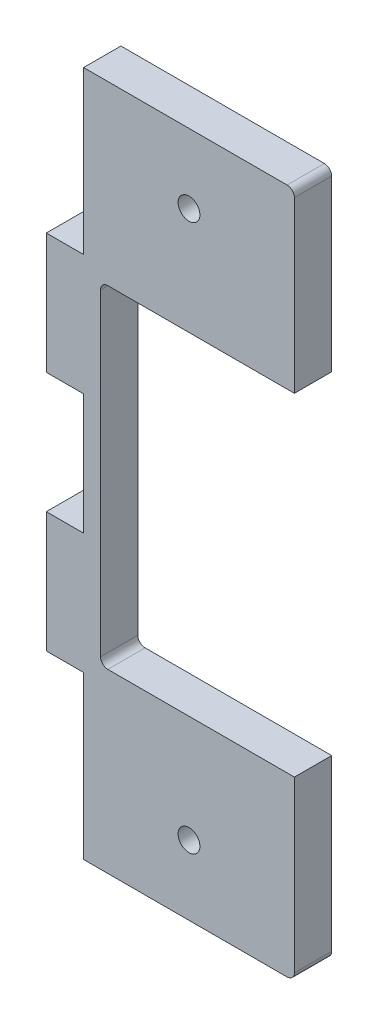
ISO-10303-21;
HEADER;
FILE_DESCRIPTION(('STEP AP214'),'2;1');
FILE_NAME('part.step','',(''),(''),'','','');
FILE_SCHEMA(('AUTOMOTIVE_DESIGN { 1 0 10303 214 1 1 1 1 }'));
ENDSEC;
DATA;
#1=APPLICATION_CONTEXT('core data for automotive mechanical design processes');
#2=APPLICATION_PROTOCOL_DEFINITION('international standard','automotive_design',2000,#1);
#3=PRODUCT_CONTEXT('',#1,'mechanical');
#4=PRODUCT('Part','Part','',(#3));
#5=PRODUCT_RELATED_PRODUCT_CATEGORY('part','',(#4));
#6=PRODUCT_DEFINITION_FORMATION('','',#4);
#7=PRODUCT_DEFINITION_CONTEXT('part definition',#1,'design');
#8=PRODUCT_DEFINITION('design','',#6,#7);
#9=PRODUCT_DEFINITION_SHAPE('','',#8);
#10=(LENGTH_UNIT() NAMED_UNIT(*) SI_UNIT(.MILLI.,.METRE.));
#11=(NAMED_UNIT(*) PLANE_ANGLE_UNIT() SI_UNIT($,.RADIAN.));
#12=(NAMED_UNIT(*) SI_UNIT($,.STERADIAN.) SOLID_ANGLE_UNIT());
#13=UNCERTAINTY_MEASURE_WITH_UNIT(LENGTH_MEASURE(1.E-05),#10,'distance_accuracy_value','');
#14=(GEOMETRIC_REPRESENTATION_CONTEXT(3) GLOBAL_UNCERTAINTY_ASSIGNED_CONTEXT((#13)) GLOBAL_UNIT_ASSIGNED_CONTEXT((#10,
#11,#12)) REPRESENTATION_CONTEXT('',''));
#15=CARTESIAN_POINT('',(0.,0.,0.));
#16=DIRECTION('',(0.,0.,1.));
#17=DIRECTION('',(1.,0.,0.));
#18=AXIS2_PLACEMENT_3D('',#15,#16,#17);
#19=CARTESIAN_POINT('',(12.5290859130973,-47.3168648264044,5.13));
#20=DIRECTION('',(-1.,0.,0.));
#21=DIRECTION('',(0.,-1.,0.));
#22=AXIS2_PLACEMENT_3D('',#19,#20,#21);
#23=PLANE('',#22);
#24=DIRECTION('',(0.,1.,0.));
#25=VECTOR('',#24,1.);
#26=CARTESIAN_POINT('',(12.5290859130973,-47.3168648264044,0.));
#27=LINE('',#26,#25);
#28=CARTESIAN_POINT('',(12.5290859130973,-47.3168648264044,0.));
#29=VERTEX_POINT('',#28);
#30=CARTESIAN_POINT('',(12.5290859130973,-23.9968648264043,0.));
#31=VERTEX_POINT('',#30);
#32=EDGE_CURVE('E195',#29,#31,#27,.T.);
#33=ORIENTED_EDGE('',*,*,#32,.T.);
#34=DIRECTION('',(0.,0.,1.));
#35=VECTOR('',#34,1.);
#36=CARTESIAN_POINT('',(12.5290859130973,-23.9968648264043,-0.00100000000000013));
#37=LINE('',#36,#35);
#38=CARTESIAN_POINT('',(12.5290859130973,-23.9968648264043,5.13));
#39=VERTEX_POINT('',#38);
#40=EDGE_CURVE('E304',#31,#39,#37,.T.);
#41=ORIENTED_EDGE('',*,*,#40,.T.);
#42=DIRECTION('',(0.,1.,0.));
#43=VECTOR('',#42,1.);
#44=CARTESIAN_POINT('',(12.5290859130973,-47.3168648264044,5.13));
#45=LINE('',#44,#43);
#46=CARTESIAN_POINT('',(12.5290859130973,-47.3168648264044,5.13));
#47=VERTEX_POINT('',#46);
#48=EDGE_CURVE('E270',#47,#39,#45,.T.);
#49=ORIENTED_EDGE('',*,*,#48,.F.);
#50=DIRECTION('',(0.,0.,-1.));
#51=VECTOR('',#50,1.);
#52=CARTESIAN_POINT('',(12.5290859130973,-47.3168648264044,5.13));
#53=LINE('',#52,#51);
#54=EDGE_CURVE('E216',#47,#29,#53,.T.);
#55=ORIENTED_EDGE('',*,*,#54,.T.);
#56=EDGE_LOOP('',(#33,#41,#49,#55));
#57=FACE_BOUND('',#56,.T.);
#58=ADVANCED_FACE('F30',(#57),#23,.F.);
#59=CARTESIAN_POINT('',(11.5290859130973,45.0431351735956,5.13));
#60=DIRECTION('',(0.,0.,1.));
#61=DIRECTION('',(1.,0.,0.));
#62=AXIS2_PLACEMENT_3D('',#59,#60,#61);
#63=PLANE('',#62);
#64=DIRECTION('',(1.,0.,0.));
#65=VECTOR('',#64,1.);
#66=CARTESIAN_POINT('',(12.5290859130973,-23.9968648264043,5.13));
#67=LINE('',#66,#65);
#68=CARTESIAN_POINT('',(-13.1409140869027,-23.9968648264043,5.13));
#69=VERTEX_POINT('',#68);
#70=EDGE_CURVE('E308',#69,#39,#67,.T.);
#71=ORIENTED_EDGE('',*,*,#70,.F.);
#72=CARTESIAN_POINT('',(-13.1409140869027,-22.9968648264043,5.13));
#73=DIRECTION('',(0.,0.,1.));
#74=DIRECTION('',(-1.,0.,0.));
#75=AXIS2_PLACEMENT_3D('',#72,#73,#74);
#76=CIRCLE('',#75,1.);
#77=CARTESIAN_POINT('',(-14.1409140869027,-22.9968648264043,5.13));
#78=VERTEX_POINT('',#77);
#79=EDGE_CURVE('E324',#78,#69,#76,.T.);
#80=ORIENTED_EDGE('',*,*,#79,.F.);
#81=DIRECTION('',(0.,-1.,0.));
#82=VECTOR('',#81,1.);
#83=CARTESIAN_POINT('',(-14.1409140869027,20.7231351735956,5.13));
#84=LINE('',#83,#82);
#85=CARTESIAN_POINT('',(-14.1409140869027,20.7231351735956,5.13));
#86=VERTEX_POINT('',#85);
#87=EDGE_CURVE('E327',#86,#78,#84,.T.);
#88=ORIENTED_EDGE('',*,*,#87,.F.);
#89=CARTESIAN_POINT('',(-13.1409140869027,20.7231351735956,5.13));
#90=DIRECTION('',(0.,0.,1.));
#91=DIRECTION('',(-1.,0.,0.));
#92=AXIS2_PLACEMENT_3D('',#89,#90,#91);
#93=CIRCLE('',#92,1.);
#94=CARTESIAN_POINT('',(-13.1409140869027,21.7231351735957,5.13));
#95=VERTEX_POINT('',#94);
#96=EDGE_CURVE('E330',#95,#86,#93,.T.);
#97=ORIENTED_EDGE('',*,*,#96,.F.);
#98=DIRECTION('',(-1.,0.,0.));
#99=VECTOR('',#98,1.);
#100=CARTESIAN_POINT('',(12.5290859130973,21.7231351735956,5.13));
#101=LINE('',#100,#99);
#102=CARTESIAN_POINT('',(12.5290859130973,21.7231351735956,5.13));
#103=VERTEX_POINT('',#102);
#104=EDGE_CURVE('E333',#103,#95,#101,.T.);
#105=ORIENTED_EDGE('',*,*,#104,.F.);
#106=CARTESIAN_POINT('',(12.5290859130973,45.0431351735956,5.13));
#107=VERTEX_POINT('',#106);
#108=EDGE_CURVE('E269',#103,#107,#45,.T.);
#109=ORIENTED_EDGE('',*,*,#108,.T.);
#110=CARTESIAN_POINT('',(11.5290859130973,45.0431351735956,5.13));
#111=DIRECTION('',(0.,0.,1.));
#112=DIRECTION('',(1.,0.,0.));
#113=AXIS2_PLACEMENT_3D('',#110,#111,#112);
#114=CIRCLE('',#113,1.);
#115=CARTESIAN_POINT('',(11.5290859130973,46.0431351735957,5.13));
#116=VERTEX_POINT('',#115);
#117=EDGE_CURVE('E273',#107,#116,#114,.T.);
#118=ORIENTED_EDGE('',*,*,#117,.T.);
#119=DIRECTION('',(-1.,0.,0.));
#120=VECTOR('',#119,1.);
#121=CARTESIAN_POINT('',(-16.4709140869027,46.0431351735956,5.13));
#122=LINE('',#121,#120);
#123=CARTESIAN_POINT('',(-16.4709140869027,46.0431351735956,5.13));
#124=VERTEX_POINT('',#123);
#125=EDGE_CURVE('E155',#116,#124,#122,.T.);
#126=ORIENTED_EDGE('',*,*,#125,.T.);
#127=DIRECTION('',(0.,-1.,0.));
#128=VECTOR('',#127,1.);
#129=CARTESIAN_POINT('',(-16.4709140869027,23.7631351735956,5.13));
#130=LINE('',#129,#128);
#131=CARTESIAN_POINT('',(-16.4709140869027,23.7631351735956,5.13));
#132=VERTEX_POINT('',#131);
#133=EDGE_CURVE('E146',#124,#132,#130,.T.);
#134=ORIENTED_EDGE('',*,*,#133,.T.);
#135=DIRECTION('',(-1.,0.,0.));
#136=VECTOR('',#135,1.);
#137=CARTESIAN_POINT('',(-21.6009140869027,23.7631351735956,5.13));
#138=LINE('',#137,#136);
#139=CARTESIAN_POINT('',(-21.6009140869027,23.7631351735956,5.13));
#140=VERTEX_POINT('',#139);
#141=EDGE_CURVE('E152',#132,#140,#138,.T.);
#142=ORIENTED_EDGE('',*,*,#141,.T.);
#143=DIRECTION('',(0.,-1.,0.));
#144=VECTOR('',#143,1.);
#145=CARTESIAN_POINT('',(-21.6009140869027,7.16313517359562,5.13));
#146=LINE('',#145,#144);
#147=CARTESIAN_POINT('',(-21.6009140869027,7.16313517359562,5.13));
#148=VERTEX_POINT('',#147);
#149=EDGE_CURVE('E54',#140,#148,#146,.T.);
#150=ORIENTED_EDGE('',*,*,#149,.T.);
#151=DIRECTION('',(1.,0.,0.));
#152=VECTOR('',#151,1.);
#153=CARTESIAN_POINT('',(-16.4709140869027,7.16313517359562,5.13));
#154=LINE('',#153,#152);
#155=CARTESIAN_POINT('',(-16.4709140869027,7.16313517359562,5.13));
#156=VERTEX_POINT('',#155);
#157=EDGE_CURVE('E206',#148,#156,#154,.T.);
#158=ORIENTED_EDGE('',*,*,#157,.T.);
#159=DIRECTION('',(0.,-1.,0.));
#160=VECTOR('',#159,1.);
#161=CARTESIAN_POINT('',(-16.4709140869027,7.16313517359562,5.13));
#162=LINE('',#161,#160);
#163=CARTESIAN_POINT('',(-16.4709140869027,-9.43686482640438,5.13));
#164=VERTEX_POINT('',#163);
#165=EDGE_CURVE('E113',#156,#164,#162,.T.);
#166=ORIENTED_EDGE('',*,*,#165,.T.);
#167=DIRECTION('',(-1.,0.,0.));
#168=VECTOR('',#167,1.);
#169=CARTESIAN_POINT('',(-16.4709140869027,-9.43686482640438,5.13));
#170=LINE('',#169,#168);
#171=CARTESIAN_POINT('',(-21.6009140869027,-9.43686482640438,5.13));
#172=VERTEX_POINT('',#171);
#173=EDGE_CURVE('E239',#164,#172,#170,.T.);
#174=ORIENTED_EDGE('',*,*,#173,.T.);
#175=DIRECTION('',(0.,-1.,0.));
#176=VECTOR('',#175,1.);
#177=CARTESIAN_POINT('',(-21.6009140869027,-9.43686482640438,5.13));
#178=LINE('',#177,#176);
#179=CARTESIAN_POINT('',(-21.6009140869027,-26.0368648264044,5.13));
#180=VERTEX_POINT('',#179);
#181=EDGE_CURVE('E259',#172,#180,#178,.T.);
#182=ORIENTED_EDGE('',*,*,#181,.T.);
#183=DIRECTION('',(1.,0.,0.));
#184=VECTOR('',#183,1.);
#185=CARTESIAN_POINT('',(-21.6009140869027,-26.0368648264044,5.13));
#186=LINE('',#185,#184);
#187=CARTESIAN_POINT('',(-16.4709140869027,-26.0368648264044,5.13));
#188=VERTEX_POINT('',#187);
#189=EDGE_CURVE('E256',#180,#188,#186,.T.);
#190=ORIENTED_EDGE('',*,*,#189,.T.);
#191=DIRECTION('',(0.,-1.,0.));
#192=VECTOR('',#191,1.);
#193=CARTESIAN_POINT('',(-16.4709140869027,-26.0368648264044,5.13));
#194=LINE('',#193,#192);
#195=CARTESIAN_POINT('',(-16.4709140869027,-48.3168648264044,5.13));
#196=VERTEX_POINT('',#195);
#197=EDGE_CURVE('E258',#188,#196,#194,.T.);
#198=ORIENTED_EDGE('',*,*,#197,.T.);
#199=DIRECTION('',(1.,0.,0.));
#200=VECTOR('',#199,1.);
#201=CARTESIAN_POINT('',(-16.4709140869027,-48.3168648264044,5.13));
#202=LINE('',#201,#200);
#203=CARTESIAN_POINT('',(11.5290859130973,-48.3168648264044,5.13));
#204=VERTEX_POINT('',#203);
#205=EDGE_CURVE('E261',#196,#204,#202,.T.);
#206=ORIENTED_EDGE('',*,*,#205,.T.);
#207=CARTESIAN_POINT('',(11.5290859130973,-47.3168648264044,5.13));
#208=DIRECTION('',(0.,0.,1.));
#209=DIRECTION('',(1.,0.,0.));
#210=AXIS2_PLACEMENT_3D('',#207,#208,#209);
#211=CIRCLE('',#210,1.);
#212=EDGE_CURVE('E267',#204,#47,#211,.T.);
#213=ORIENTED_EDGE('',*,*,#212,.T.);
#214=ORIENTED_EDGE('',*,*,#48,.T.);
#215=EDGE_LOOP('',(#71,#80,#88,#97,#105,#109,#118,#126,#134,#142,#150,#158,#166,#174,#182,#190,
#198,#206,#213,#214));
#216=FACE_BOUND('',#215,.T.);
#217=CARTESIAN_POINT('',(-1.97091408690269,-38.7508648264044,5.13));
#218=DIRECTION('',(0.,0.,1.));
#219=DIRECTION('',(1.,0.,0.));
#220=AXIS2_PLACEMENT_3D('',#217,#218,#219);
#221=CIRCLE('',#220,1.5);
#222=CARTESIAN_POINT('',(-0.470914086902686,-38.7508648264044,5.13));
#223=VERTEX_POINT('',#222);
#224=EDGE_CURVE('E180',#223,#223,#221,.T.);
#225=ORIENTED_EDGE('',*,*,#224,.F.);
#226=EDGE_LOOP('',(#225));
#227=FACE_BOUND('',#226,.T.);
#228=CARTESIAN_POINT('',(-1.97091408690271,36.4771351735956,5.13));
#229=DIRECTION('',(0.,0.,1.));
#230=DIRECTION('',(1.,0.,0.));
#231=AXIS2_PLACEMENT_3D('',#228,#229,#230);
#232=CIRCLE('',#231,1.5);
#233=CARTESIAN_POINT('',(-0.470914086902709,36.4771351735956,5.13));
#234=VERTEX_POINT('',#233);
#235=EDGE_CURVE('E295',#234,#234,#232,.T.);
#236=ORIENTED_EDGE('',*,*,#235,.F.);
#237=EDGE_LOOP('',(#236));
#238=FACE_BOUND('',#237,.T.);
#239=ADVANCED_FACE('F149',(#216,#227,#238),#63,.T.);
#240=CARTESIAN_POINT('',(11.5290859130973,45.0431351735956,0.));
#241=DIRECTION('',(0.,0.,1.));
#242=DIRECTION('',(1.,0.,0.));
#243=AXIS2_PLACEMENT_3D('',#240,#241,#242);
#244=PLANE('',#243);
#245=CARTESIAN_POINT('',(-1.97091408690269,-38.7508648264044,0.));
#246=DIRECTION('',(0.,0.,1.));
#247=DIRECTION('',(1.,0.,0.));
#248=AXIS2_PLACEMENT_3D('',#245,#246,#247);
#249=CIRCLE('',#248,1.5);
#250=CARTESIAN_POINT('',(-0.470914086902686,-38.7508648264044,0.));
#251=VERTEX_POINT('',#250);
#252=EDGE_CURVE('E292',#251,#251,#249,.T.);
#253=ORIENTED_EDGE('',*,*,#252,.T.);
#254=EDGE_LOOP('',(#253));
#255=FACE_BOUND('',#254,.T.);
#256=CARTESIAN_POINT('',(-13.1409140869027,-22.9968648264043,0.));
#257=DIRECTION('',(0.,0.,1.));
#258=DIRECTION('',(1.,0.,0.));
#259=AXIS2_PLACEMENT_3D('',#256,#257,#258);
#260=CIRCLE('',#259,1.);
#261=CARTESIAN_POINT('',(-13.1409140869027,-23.9968648264043,0.));
#262=VERTEX_POINT('',#261);
#263=CARTESIAN_POINT('',(-14.1409140869027,-22.9968648264043,0.));
#264=VERTEX_POINT('',#263);
#265=EDGE_CURVE('E339',#262,#264,#260,.F.);
#266=ORIENTED_EDGE('',*,*,#265,.F.);
#267=DIRECTION('',(-1.,0.,0.));
#268=VECTOR('',#267,1.);
#269=CARTESIAN_POINT('',(12.5290859130973,-23.9968648264043,0.));
#270=LINE('',#269,#268);
#271=EDGE_CURVE('E336',#31,#262,#270,.T.);
#272=ORIENTED_EDGE('',*,*,#271,.F.);
#273=ORIENTED_EDGE('',*,*,#32,.F.);
#274=CARTESIAN_POINT('',(11.5290859130973,-47.3168648264044,0.));
#275=DIRECTION('',(0.,0.,1.));
#276=DIRECTION('',(1.,0.,0.));
#277=AXIS2_PLACEMENT_3D('',#274,#275,#276);
#278=CIRCLE('',#277,1.);
#279=CARTESIAN_POINT('',(11.5290859130973,-48.3168648264044,0.));
#280=VERTEX_POINT('',#279);
#281=EDGE_CURVE('E192',#280,#29,#278,.T.);
#282=ORIENTED_EDGE('',*,*,#281,.F.);
#283=DIRECTION('',(1.,0.,0.));
#284=VECTOR('',#283,1.);
#285=CARTESIAN_POINT('',(-16.4709140869027,-48.3168648264044,0.));
#286=LINE('',#285,#284);
#287=CARTESIAN_POINT('',(-16.4709140869027,-48.3168648264044,0.));
#288=VERTEX_POINT('',#287);
#289=EDGE_CURVE('E190',#288,#280,#286,.T.);
#290=ORIENTED_EDGE('',*,*,#289,.F.);
#291=DIRECTION('',(0.,-1.,0.));
#292=VECTOR('',#291,1.);
#293=CARTESIAN_POINT('',(-16.4709140869027,-26.0368648264044,0.));
#294=LINE('',#293,#292);
#295=CARTESIAN_POINT('',(-16.4709140869027,-26.0368648264044,0.));
#296=VERTEX_POINT('',#295);
#297=EDGE_CURVE('E188',#296,#288,#294,.T.);
#298=ORIENTED_EDGE('',*,*,#297,.F.);
#299=DIRECTION('',(1.,0.,0.));
#300=VECTOR('',#299,1.);
#301=CARTESIAN_POINT('',(-21.6009140869027,-26.0368648264044,0.));
#302=LINE('',#301,#300);
#303=CARTESIAN_POINT('',(-21.6009140869027,-26.0368648264044,0.));
#304=VERTEX_POINT('',#303);
#305=EDGE_CURVE('E186',#304,#296,#302,.T.);
#306=ORIENTED_EDGE('',*,*,#305,.F.);
#307=DIRECTION('',(0.,-1.,0.));
#308=VECTOR('',#307,1.);
#309=CARTESIAN_POINT('',(-21.6009140869027,-9.43686482640438,0.));
#310=LINE('',#309,#308);
#311=CARTESIAN_POINT('',(-21.6009140869027,-9.43686482640438,0.));
#312=VERTEX_POINT('',#311);
#313=EDGE_CURVE('E184',#312,#304,#310,.T.);
#314=ORIENTED_EDGE('',*,*,#313,.F.);
#315=DIRECTION('',(-1.,0.,0.));
#316=VECTOR('',#315,1.);
#317=CARTESIAN_POINT('',(-16.4709140869027,-9.43686482640438,0.));
#318=LINE('',#317,#316);
#319=CARTESIAN_POINT('',(-16.4709140869027,-9.43686482640438,0.));
#320=VERTEX_POINT('',#319);
#321=EDGE_CURVE('E182',#320,#312,#318,.T.);
#322=ORIENTED_EDGE('',*,*,#321,.F.);
#323=DIRECTION('',(0.,-1.,0.));
#324=VECTOR('',#323,1.);
#325=CARTESIAN_POINT('',(-16.4709140869027,7.16313517359562,0.));
#326=LINE('',#325,#324);
#327=CARTESIAN_POINT('',(-16.4709140869027,7.16313517359562,0.));
#328=VERTEX_POINT('',#327);
#329=EDGE_CURVE('E179',#328,#320,#326,.T.);
#330=ORIENTED_EDGE('',*,*,#329,.F.);
#331=DIRECTION('',(1.,0.,0.));
#332=VECTOR('',#331,1.);
#333=CARTESIAN_POINT('',(-16.4709140869027,7.16313517359562,0.));
#334=LINE('',#333,#332);
#335=CARTESIAN_POINT('',(-21.6009140869027,7.16313517359562,0.));
#336=VERTEX_POINT('',#335);
#337=EDGE_CURVE('E176',#336,#328,#334,.T.);
#338=ORIENTED_EDGE('',*,*,#337,.F.);
#339=DIRECTION('',(0.,-1.,0.));
#340=VECTOR('',#339,1.);
#341=CARTESIAN_POINT('',(-21.6009140869027,7.16313517359562,0.));
#342=LINE('',#341,#340);
#343=CARTESIAN_POINT('',(-21.6009140869027,23.7631351735956,0.));
#344=VERTEX_POINT('',#343);
#345=EDGE_CURVE('E105',#344,#336,#342,.T.);
#346=ORIENTED_EDGE('',*,*,#345,.F.);
#347=DIRECTION('',(-1.,0.,0.));
#348=VECTOR('',#347,1.);
#349=CARTESIAN_POINT('',(-21.6009140869027,23.7631351735956,0.));
#350=LINE('',#349,#348);
#351=CARTESIAN_POINT('',(-16.4709140869027,23.7631351735956,0.));
#352=VERTEX_POINT('',#351);
#353=EDGE_CURVE('E203',#352,#344,#350,.T.);
#354=ORIENTED_EDGE('',*,*,#353,.F.);
#355=DIRECTION('',(0.,-1.,0.));
#356=VECTOR('',#355,1.);
#357=CARTESIAN_POINT('',(-16.4709140869027,23.7631351735956,0.));
#358=LINE('',#357,#356);
#359=CARTESIAN_POINT('',(-16.4709140869027,46.0431351735956,0.));
#360=VERTEX_POINT('',#359);
#361=EDGE_CURVE('E164',#360,#352,#358,.T.);
#362=ORIENTED_EDGE('',*,*,#361,.F.);
#363=DIRECTION('',(-1.,0.,0.));
#364=VECTOR('',#363,1.);
#365=CARTESIAN_POINT('',(-16.4709140869027,46.0431351735956,0.));
#366=LINE('',#365,#364);
#367=CARTESIAN_POINT('',(11.5290859130973,46.0431351735957,0.));
#368=VERTEX_POINT('',#367);
#369=EDGE_CURVE('E200',#368,#360,#366,.T.);
#370=ORIENTED_EDGE('',*,*,#369,.F.);
#371=CARTESIAN_POINT('',(11.5290859130973,45.0431351735956,0.));
#372=DIRECTION('',(0.,0.,1.));
#373=DIRECTION('',(1.,0.,0.));
#374=AXIS2_PLACEMENT_3D('',#371,#372,#373);
#375=CIRCLE('',#374,1.);
#376=CARTESIAN_POINT('',(12.5290859130973,45.0431351735956,0.));
#377=VERTEX_POINT('',#376);
#378=EDGE_CURVE('E198',#377,#368,#375,.T.);
#379=ORIENTED_EDGE('',*,*,#378,.F.);
#380=CARTESIAN_POINT('',(12.5290859130973,21.7231351735956,0.));
#381=VERTEX_POINT('',#380);
#382=EDGE_CURVE('E194',#381,#377,#27,.T.);
#383=ORIENTED_EDGE('',*,*,#382,.F.);
#384=DIRECTION('',(1.,0.,0.));
#385=VECTOR('',#384,1.);
#386=CARTESIAN_POINT('',(12.5290859130973,21.7231351735956,0.));
#387=LINE('',#386,#385);
#388=CARTESIAN_POINT('',(-13.1409140869027,21.7231351735957,0.));
#389=VERTEX_POINT('',#388);
#390=EDGE_CURVE('E45',#389,#381,#387,.T.);
#391=ORIENTED_EDGE('',*,*,#390,.F.);
#392=CARTESIAN_POINT('',(-13.1409140869027,20.7231351735956,0.));
#393=DIRECTION('',(0.,0.,1.));
#394=DIRECTION('',(1.,0.,0.));
#395=AXIS2_PLACEMENT_3D('',#392,#393,#394);
#396=CIRCLE('',#395,1.);
#397=CARTESIAN_POINT('',(-14.1409140869027,20.7231351735956,0.));
#398=VERTEX_POINT('',#397);
#399=EDGE_CURVE('E345',#398,#389,#396,.F.);
#400=ORIENTED_EDGE('',*,*,#399,.F.);
#401=DIRECTION('',(0.,1.,0.));
#402=VECTOR('',#401,1.);
#403=CARTESIAN_POINT('',(-14.1409140869027,20.7231351735956,0.));
#404=LINE('',#403,#402);
#405=EDGE_CURVE('E342',#264,#398,#404,.T.);
#406=ORIENTED_EDGE('',*,*,#405,.F.);
#407=EDGE_LOOP('',(#266,#272,#273,#282,#290,#298,#306,#314,#322,#330,#338,#346,#354,#362,#370,
#379,#383,#391,#400,#406));
#408=FACE_BOUND('',#407,.T.);
#409=CARTESIAN_POINT('',(-1.97091408690271,36.4771351735956,0.));
#410=DIRECTION('',(0.,0.,1.));
#411=DIRECTION('',(1.,0.,0.));
#412=AXIS2_PLACEMENT_3D('',#409,#410,#411);
#413=CIRCLE('',#412,1.5);
#414=CARTESIAN_POINT('',(-0.470914086902709,36.4771351735956,0.));
#415=VERTEX_POINT('',#414);
#416=EDGE_CURVE('E298',#415,#415,#413,.T.);
#417=ORIENTED_EDGE('',*,*,#416,.T.);
#418=EDGE_LOOP('',(#417));
#419=FACE_BOUND('',#418,.T.);
#420=ADVANCED_FACE('F243',(#255,#408,#419),#244,.F.);
#421=CARTESIAN_POINT('',(-16.4709140869027,7.16313517359562,5.13));
#422=DIRECTION('',(0.,1.,0.));
#423=DIRECTION('',(-1.,0.,0.));
#424=AXIS2_PLACEMENT_3D('',#421,#422,#423);
#425=PLANE('',#424);
#426=ORIENTED_EDGE('',*,*,#337,.T.);
#427=DIRECTION('',(0.,0.,-1.));
#428=VECTOR('',#427,1.);
#429=CARTESIAN_POINT('',(-16.4709140869027,7.16313517359562,5.13));
#430=LINE('',#429,#428);
#431=EDGE_CURVE('E11',#156,#328,#430,.T.);
#432=ORIENTED_EDGE('',*,*,#431,.F.);
#433=ORIENTED_EDGE('',*,*,#157,.F.);
#434=DIRECTION('',(0.,0.,-1.));
#435=VECTOR('',#434,1.);
#436=CARTESIAN_POINT('',(-21.6009140869027,7.16313517359562,5.13));
#437=LINE('',#436,#435);
#438=EDGE_CURVE('E172',#148,#336,#437,.T.);
#439=ORIENTED_EDGE('',*,*,#438,.T.);
#440=EDGE_LOOP('',(#426,#432,#433,#439));
#441=FACE_BOUND('',#440,.T.);
#442=ADVANCED_FACE('F32',(#441),#425,.F.);
#443=CARTESIAN_POINT('',(-16.4709140869027,7.16313517359562,5.13));
#444=DIRECTION('',(1.,0.,0.));
#445=DIRECTION('',(0.,1.,0.));
#446=AXIS2_PLACEMENT_3D('',#443,#444,#445);
#447=PLANE('',#446);
#448=ORIENTED_EDGE('',*,*,#329,.T.);
#449=DIRECTION('',(0.,0.,-1.));
#450=VECTOR('',#449,1.);
#451=CARTESIAN_POINT('',(-16.4709140869027,-9.43686482640438,5.13));
#452=LINE('',#451,#450);
#453=EDGE_CURVE('E38',#164,#320,#452,.T.);
#454=ORIENTED_EDGE('',*,*,#453,.F.);
#455=ORIENTED_EDGE('',*,*,#165,.F.);
#456=ORIENTED_EDGE('',*,*,#431,.T.);
#457=EDGE_LOOP('',(#448,#454,#455,#456));
#458=FACE_BOUND('',#457,.T.);
#459=ADVANCED_FACE('F437',(#458),#447,.F.);
#460=CARTESIAN_POINT('',(-16.4709140869027,-9.43686482640438,5.13));
#461=DIRECTION('',(0.,-1.,0.));
#462=DIRECTION('',(1.,0.,0.));
#463=AXIS2_PLACEMENT_3D('',#460,#461,#462);
#464=PLANE('',#463);
#465=ORIENTED_EDGE('',*,*,#321,.T.);
#466=DIRECTION('',(0.,0.,-1.));
#467=VECTOR('',#466,1.);
#468=CARTESIAN_POINT('',(-21.6009140869027,-9.43686482640438,5.13));
#469=LINE('',#468,#467);
#470=EDGE_CURVE('E231',#172,#312,#469,.T.);
#471=ORIENTED_EDGE('',*,*,#470,.F.);
#472=ORIENTED_EDGE('',*,*,#173,.F.);
#473=ORIENTED_EDGE('',*,*,#453,.T.);
#474=EDGE_LOOP('',(#465,#471,#472,#473));
#475=FACE_BOUND('',#474,.T.);
#476=ADVANCED_FACE('F237',(#475),#464,.F.);
#477=CARTESIAN_POINT('',(-21.6009140869027,-9.43686482640438,5.13));
#478=DIRECTION('',(1.,0.,0.));
#479=DIRECTION('',(0.,0.,-1.));
#480=AXIS2_PLACEMENT_3D('',#477,#478,#479);
#481=PLANE('',#480);
#482=ORIENTED_EDGE('',*,*,#313,.T.);
#483=DIRECTION('',(0.,0.,-1.));
#484=VECTOR('',#483,1.);
#485=CARTESIAN_POINT('',(-21.6009140869027,-26.0368648264044,5.13));
#486=LINE('',#485,#484);
#487=EDGE_CURVE('E228',#180,#304,#486,.T.);
#488=ORIENTED_EDGE('',*,*,#487,.F.);
#489=ORIENTED_EDGE('',*,*,#181,.F.);
#490=ORIENTED_EDGE('',*,*,#470,.T.);
#491=EDGE_LOOP('',(#482,#488,#489,#490));
#492=FACE_BOUND('',#491,.T.);
#493=ADVANCED_FACE('F250',(#492),#481,.F.);
#494=CARTESIAN_POINT('',(-21.6009140869027,-26.0368648264044,5.13));
#495=DIRECTION('',(0.,1.,0.));
#496=DIRECTION('',(0.,0.,1.));
#497=AXIS2_PLACEMENT_3D('',#494,#495,#496);
#498=PLANE('',#497);
#499=ORIENTED_EDGE('',*,*,#305,.T.);
#500=DIRECTION('',(0.,0.,-1.));
#501=VECTOR('',#500,1.);
#502=CARTESIAN_POINT('',(-16.4709140869027,-26.0368648264044,5.13));
#503=LINE('',#502,#501);
#504=EDGE_CURVE('E225',#188,#296,#503,.T.);
#505=ORIENTED_EDGE('',*,*,#504,.F.);
#506=ORIENTED_EDGE('',*,*,#189,.F.);
#507=ORIENTED_EDGE('',*,*,#487,.T.);
#508=EDGE_LOOP('',(#499,#505,#506,#507));
#509=FACE_BOUND('',#508,.T.);
#510=ADVANCED_FACE('F254',(#509),#498,.F.);
#511=CARTESIAN_POINT('',(-16.4709140869027,-26.0368648264044,5.13));
#512=DIRECTION('',(1.,0.,0.));
#513=DIRECTION('',(0.,1.,0.));
#514=AXIS2_PLACEMENT_3D('',#511,#512,#513);
#515=PLANE('',#514);
#516=ORIENTED_EDGE('',*,*,#297,.T.);
#517=DIRECTION('',(0.,0.,-1.));
#518=VECTOR('',#517,1.);
#519=CARTESIAN_POINT('',(-16.4709140869027,-48.3168648264044,5.13));
#520=LINE('',#519,#518);
#521=EDGE_CURVE('E222',#196,#288,#520,.T.);
#522=ORIENTED_EDGE('',*,*,#521,.F.);
#523=ORIENTED_EDGE('',*,*,#197,.F.);
#524=ORIENTED_EDGE('',*,*,#504,.T.);
#525=EDGE_LOOP('',(#516,#522,#523,#524));
#526=FACE_BOUND('',#525,.T.);
#527=ADVANCED_FACE('F401',(#526),#515,.F.);
#528=CARTESIAN_POINT('',(-16.4709140869027,-48.3168648264044,5.13));
#529=DIRECTION('',(0.,1.,0.));
#530=DIRECTION('',(0.,0.,1.));
#531=AXIS2_PLACEMENT_3D('',#528,#529,#530);
#532=PLANE('',#531);
#533=ORIENTED_EDGE('',*,*,#289,.T.);
#534=DIRECTION('',(0.,0.,-1.));
#535=VECTOR('',#534,1.);
#536=CARTESIAN_POINT('',(11.5290859130973,-48.3168648264044,5.13));
#537=LINE('',#536,#535);
#538=EDGE_CURVE('E219',#204,#280,#537,.T.);
#539=ORIENTED_EDGE('',*,*,#538,.F.);
#540=ORIENTED_EDGE('',*,*,#205,.F.);
#541=ORIENTED_EDGE('',*,*,#521,.T.);
#542=EDGE_LOOP('',(#533,#539,#540,#541));
#543=FACE_BOUND('',#542,.T.);
#544=ADVANCED_FACE('F397',(#543),#532,.F.);
#545=CARTESIAN_POINT('',(11.5290859130973,-47.3168648264044,5.13));
#546=DIRECTION('',(0.,0.,-1.));
#547=DIRECTION('',(-1.,0.,0.));
#548=AXIS2_PLACEMENT_3D('',#545,#546,#547);
#549=CYLINDRICAL_SURFACE('',#548,1.);
#550=ORIENTED_EDGE('',*,*,#281,.T.);
#551=ORIENTED_EDGE('',*,*,#54,.F.);
#552=ORIENTED_EDGE('',*,*,#212,.F.);
#553=ORIENTED_EDGE('',*,*,#538,.T.);
#554=EDGE_LOOP('',(#550,#551,#552,#553));
#555=FACE_BOUND('',#554,.T.);
#556=ADVANCED_FACE('F393',(#555),#549,.T.);
#557=ORIENTED_EDGE('',*,*,#108,.F.);
#558=DIRECTION('',(0.,0.,1.));
#559=VECTOR('',#558,1.);
#560=CARTESIAN_POINT('',(12.5290859130973,21.7231351735956,-0.00100000000000013));
#561=LINE('',#560,#559);
#562=EDGE_CURVE('E305',#381,#103,#561,.T.);
#563=ORIENTED_EDGE('',*,*,#562,.F.);
#564=ORIENTED_EDGE('',*,*,#382,.T.);
#565=DIRECTION('',(0.,0.,-1.));
#566=VECTOR('',#565,1.);
#567=CARTESIAN_POINT('',(12.5290859130973,45.0431351735956,5.13));
#568=LINE('',#567,#566);
#569=EDGE_CURVE('E213',#107,#377,#568,.T.);
#570=ORIENTED_EDGE('',*,*,#569,.F.);
#571=EDGE_LOOP('',(#557,#563,#564,#570));
#572=FACE_BOUND('',#571,.T.);
#573=ADVANCED_FACE('F359',(#572),#23,.F.);
#574=CARTESIAN_POINT('',(11.5290859130973,45.0431351735956,5.13));
#575=DIRECTION('',(0.,0.,-1.));
#576=DIRECTION('',(-1.,0.,0.));
#577=AXIS2_PLACEMENT_3D('',#574,#575,#576);
#578=CYLINDRICAL_SURFACE('',#577,1.);
#579=ORIENTED_EDGE('',*,*,#378,.T.);
#580=DIRECTION('',(0.,0.,-1.));
#581=VECTOR('',#580,1.);
#582=CARTESIAN_POINT('',(11.5290859130973,46.0431351735957,5.13));
#583=LINE('',#582,#581);
#584=EDGE_CURVE('E210',#116,#368,#583,.T.);
#585=ORIENTED_EDGE('',*,*,#584,.F.);
#586=ORIENTED_EDGE('',*,*,#117,.F.);
#587=ORIENTED_EDGE('',*,*,#569,.T.);
#588=EDGE_LOOP('',(#579,#585,#586,#587));
#589=FACE_BOUND('',#588,.T.);
#590=ADVANCED_FACE('F280',(#589),#578,.T.);
#591=CARTESIAN_POINT('',(-16.4709140869027,46.0431351735956,5.13));
#592=DIRECTION('',(0.,-1.,0.));
#593=DIRECTION('',(1.,0.,0.));
#594=AXIS2_PLACEMENT_3D('',#591,#592,#593);
#595=PLANE('',#594);
#596=ORIENTED_EDGE('',*,*,#369,.T.);
#597=DIRECTION('',(0.,0.,-1.));
#598=VECTOR('',#597,1.);
#599=CARTESIAN_POINT('',(-16.4709140869027,46.0431351735956,5.13));
#600=LINE('',#599,#598);
#601=EDGE_CURVE('E167',#124,#360,#600,.T.);
#602=ORIENTED_EDGE('',*,*,#601,.F.);
#603=ORIENTED_EDGE('',*,*,#125,.F.);
#604=ORIENTED_EDGE('',*,*,#584,.T.);
#605=EDGE_LOOP('',(#596,#602,#603,#604));
#606=FACE_BOUND('',#605,.T.);
#607=ADVANCED_FACE('F284',(#606),#595,.F.);
#608=CARTESIAN_POINT('',(-16.4709140869027,23.7631351735956,5.13));
#609=DIRECTION('',(1.,0.,0.));
#610=DIRECTION('',(0.,1.,0.));
#611=AXIS2_PLACEMENT_3D('',#608,#609,#610);
#612=PLANE('',#611);
#613=ORIENTED_EDGE('',*,*,#361,.T.);
#614=DIRECTION('',(0.,0.,-1.));
#615=VECTOR('',#614,1.);
#616=CARTESIAN_POINT('',(-16.4709140869027,23.7631351735956,5.13));
#617=LINE('',#616,#615);
#618=EDGE_CURVE('E161',#132,#352,#617,.T.);
#619=ORIENTED_EDGE('',*,*,#618,.F.);
#620=ORIENTED_EDGE('',*,*,#133,.F.);
#621=ORIENTED_EDGE('',*,*,#601,.T.);
#622=EDGE_LOOP('',(#613,#619,#620,#621));
#623=FACE_BOUND('',#622,.T.);
#624=ADVANCED_FACE('F162',(#623),#612,.F.);
#625=CARTESIAN_POINT('',(-21.6009140869027,23.7631351735956,5.13));
#626=DIRECTION('',(0.,-1.,0.));
#627=DIRECTION('',(0.,0.,-1.));
#628=AXIS2_PLACEMENT_3D('',#625,#626,#627);
#629=PLANE('',#628);
#630=ORIENTED_EDGE('',*,*,#353,.T.);
#631=DIRECTION('',(0.,0.,-1.));
#632=VECTOR('',#631,1.);
#633=CARTESIAN_POINT('',(-21.6009140869027,23.7631351735956,5.13));
#634=LINE('',#633,#632);
#635=EDGE_CURVE('E168',#140,#344,#634,.T.);
#636=ORIENTED_EDGE('',*,*,#635,.F.);
#637=ORIENTED_EDGE('',*,*,#141,.F.);
#638=ORIENTED_EDGE('',*,*,#618,.T.);
#639=EDGE_LOOP('',(#630,#636,#637,#638));
#640=FACE_BOUND('',#639,.T.);
#641=ADVANCED_FACE('F170',(#640),#629,.F.);
#642=CARTESIAN_POINT('',(-21.6009140869027,7.16313517359562,5.13));
#643=DIRECTION('',(1.,0.,0.));
#644=DIRECTION('',(0.,0.,-1.));
#645=AXIS2_PLACEMENT_3D('',#642,#643,#644);
#646=PLANE('',#645);
#647=ORIENTED_EDGE('',*,*,#345,.T.);
#648=ORIENTED_EDGE('',*,*,#438,.F.);
#649=ORIENTED_EDGE('',*,*,#149,.F.);
#650=ORIENTED_EDGE('',*,*,#635,.T.);
#651=EDGE_LOOP('',(#647,#648,#649,#650));
#652=FACE_BOUND('',#651,.T.);
#653=ADVANCED_FACE('F285',(#652),#646,.F.);
#654=CARTESIAN_POINT('',(-1.97091408690269,-38.7508648264044,5.13));
#655=DIRECTION('',(0.,0.,-1.));
#656=DIRECTION('',(-1.,0.,0.));
#657=AXIS2_PLACEMENT_3D('',#654,#655,#656);
#658=CYLINDRICAL_SURFACE('',#657,1.5);
#659=ORIENTED_EDGE('',*,*,#224,.T.);
#660=EDGE_LOOP('',(#659));
#661=FACE_BOUND('',#660,.T.);
#662=ORIENTED_EDGE('',*,*,#252,.F.);
#663=EDGE_LOOP('',(#662));
#664=FACE_BOUND('',#663,.T.);
#665=ADVANCED_FACE('F453',(#661,#664),#658,.F.);
#666=CARTESIAN_POINT('',(-1.97091408690271,36.4771351735956,5.13));
#667=DIRECTION('',(0.,0.,-1.));
#668=DIRECTION('',(-1.,0.,0.));
#669=AXIS2_PLACEMENT_3D('',#666,#667,#668);
#670=CYLINDRICAL_SURFACE('',#669,1.5);
#671=ORIENTED_EDGE('',*,*,#235,.T.);
#672=EDGE_LOOP('',(#671));
#673=FACE_BOUND('',#672,.T.);
#674=ORIENTED_EDGE('',*,*,#416,.F.);
#675=EDGE_LOOP('',(#674));
#676=FACE_BOUND('',#675,.T.);
#677=ADVANCED_FACE('F481',(#673,#676),#670,.F.);
#678=CARTESIAN_POINT('',(12.5290859130973,-23.9968648264043,-0.00100000000000013));
#679=DIRECTION('',(0.,-1.,0.));
#680=DIRECTION('',(1.,0.,0.));
#681=AXIS2_PLACEMENT_3D('',#678,#679,#680);
#682=PLANE('',#681);
#683=ORIENTED_EDGE('',*,*,#271,.T.);
#684=DIRECTION('',(0.,0.,1.));
#685=VECTOR('',#684,1.);
#686=CARTESIAN_POINT('',(-13.1409140869027,-23.9968648264043,-0.00100000000000013));
#687=LINE('',#686,#685);
#688=EDGE_CURVE('E317',#262,#69,#687,.T.);
#689=ORIENTED_EDGE('',*,*,#688,.T.);
#690=ORIENTED_EDGE('',*,*,#70,.T.);
#691=ORIENTED_EDGE('',*,*,#40,.F.);
#692=EDGE_LOOP('',(#683,#689,#690,#691));
#693=FACE_BOUND('',#692,.T.);
#694=ADVANCED_FACE('F385',(#693),#682,.F.);
#695=CARTESIAN_POINT('',(-13.1409140869027,-22.9968648264043,-0.00100000000000013));
#696=DIRECTION('',(0.,0.,1.));
#697=DIRECTION('',(1.,0.,0.));
#698=AXIS2_PLACEMENT_3D('',#695,#696,#697);
#699=CYLINDRICAL_SURFACE('',#698,1.);
#700=ORIENTED_EDGE('',*,*,#265,.T.);
#701=DIRECTION('',(0.,0.,1.));
#702=VECTOR('',#701,1.);
#703=CARTESIAN_POINT('',(-14.1409140869027,-22.9968648264043,-0.00100000000000013));
#704=LINE('',#703,#702);
#705=EDGE_CURVE('E314',#264,#78,#704,.T.);
#706=ORIENTED_EDGE('',*,*,#705,.T.);
#707=ORIENTED_EDGE('',*,*,#79,.T.);
#708=ORIENTED_EDGE('',*,*,#688,.F.);
#709=EDGE_LOOP('',(#700,#706,#707,#708));
#710=FACE_BOUND('',#709,.T.);
#711=ADVANCED_FACE('F402',(#710),#699,.F.);
#712=CARTESIAN_POINT('',(-14.1409140869027,20.7231351735956,-0.00100000000000013));
#713=DIRECTION('',(-1.,0.,0.));
#714=DIRECTION('',(0.,-1.,0.));
#715=AXIS2_PLACEMENT_3D('',#712,#713,#714);
#716=PLANE('',#715);
#717=ORIENTED_EDGE('',*,*,#405,.T.);
#718=DIRECTION('',(0.,0.,1.));
#719=VECTOR('',#718,1.);
#720=CARTESIAN_POINT('',(-14.1409140869027,20.7231351735956,-0.00100000000000013));
#721=LINE('',#720,#719);
#722=EDGE_CURVE('E311',#398,#86,#721,.T.);
#723=ORIENTED_EDGE('',*,*,#722,.T.);
#724=ORIENTED_EDGE('',*,*,#87,.T.);
#725=ORIENTED_EDGE('',*,*,#705,.F.);
#726=EDGE_LOOP('',(#717,#723,#724,#725));
#727=FACE_BOUND('',#726,.T.);
#728=ADVANCED_FACE('F403',(#727),#716,.F.);
#729=CARTESIAN_POINT('',(-13.1409140869027,20.7231351735956,-0.00100000000000013));
#730=DIRECTION('',(0.,0.,1.));
#731=DIRECTION('',(1.,0.,0.));
#732=AXIS2_PLACEMENT_3D('',#729,#730,#731);
#733=CYLINDRICAL_SURFACE('',#732,1.);
#734=ORIENTED_EDGE('',*,*,#399,.T.);
#735=DIRECTION('',(0.,0.,1.));
#736=VECTOR('',#735,1.);
#737=CARTESIAN_POINT('',(-13.1409140869027,21.7231351735957,-0.00100000000000013));
#738=LINE('',#737,#736);
#739=EDGE_CURVE('E307',#389,#95,#738,.T.);
#740=ORIENTED_EDGE('',*,*,#739,.T.);
#741=ORIENTED_EDGE('',*,*,#96,.T.);
#742=ORIENTED_EDGE('',*,*,#722,.F.);
#743=EDGE_LOOP('',(#734,#740,#741,#742));
#744=FACE_BOUND('',#743,.T.);
#745=ADVANCED_FACE('F351',(#744),#733,.F.);
#746=CARTESIAN_POINT('',(12.5290859130973,21.7231351735956,-0.00100000000000013));
#747=DIRECTION('',(0.,1.,0.));
#748=DIRECTION('',(-1.,0.,0.));
#749=AXIS2_PLACEMENT_3D('',#746,#747,#748);
#750=PLANE('',#749);
#751=ORIENTED_EDGE('',*,*,#390,.T.);
#752=ORIENTED_EDGE('',*,*,#562,.T.);
#753=ORIENTED_EDGE('',*,*,#104,.T.);
#754=ORIENTED_EDGE('',*,*,#739,.F.);
#755=EDGE_LOOP('',(#751,#752,#753,#754));
#756=FACE_BOUND('',#755,.T.);
#757=ADVANCED_FACE('F361',(#756),#750,.F.);
#758=CLOSED_SHELL('',(#58,#239,#420,#442,#459,#476,#493,#510,#527,#544,#556,#573,#590,#607,#624,
#641,#653,#665,#677,#694,#711,#728,#745,#757));
#759=MANIFOLD_SOLID_BREP('B2',#758);
#760=ADVANCED_BREP_SHAPE_REPRESENTATION('',(#18,#759),#14);
#761=SHAPE_DEFINITION_REPRESENTATION(#9,#760);
ENDSEC;
END-ISO-10303-21;
